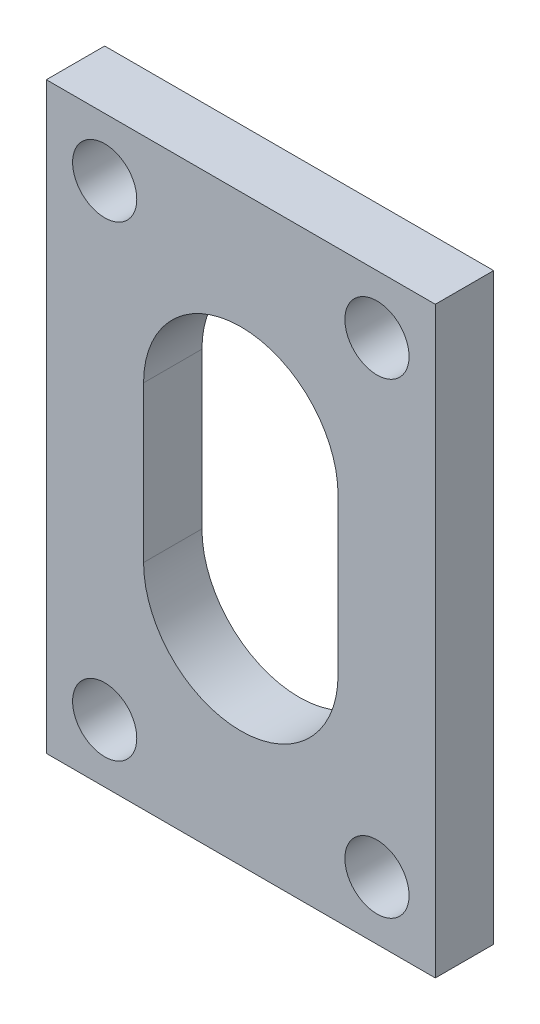
ISO-10303-21;
HEADER;
FILE_DESCRIPTION(('STEP AP214'),'2;1');
FILE_NAME('part.step','',(''),(''),'','','');
FILE_SCHEMA(('AUTOMOTIVE_DESIGN { 1 0 10303 214 1 1 1 1 }'));
ENDSEC;
DATA;
#1=APPLICATION_CONTEXT('core data for automotive mechanical design processes');
#2=APPLICATION_PROTOCOL_DEFINITION('international standard','automotive_design',2000,#1);
#3=PRODUCT_CONTEXT('',#1,'mechanical');
#4=PRODUCT('Part','Part','',(#3));
#5=PRODUCT_RELATED_PRODUCT_CATEGORY('part','',(#4));
#6=PRODUCT_DEFINITION_FORMATION('','',#4);
#7=PRODUCT_DEFINITION_CONTEXT('part definition',#1,'design');
#8=PRODUCT_DEFINITION('design','',#6,#7);
#9=PRODUCT_DEFINITION_SHAPE('','',#8);
#10=(LENGTH_UNIT() NAMED_UNIT(*) SI_UNIT(.MILLI.,.METRE.));
#11=(NAMED_UNIT(*) PLANE_ANGLE_UNIT() SI_UNIT($,.RADIAN.));
#12=(NAMED_UNIT(*) SI_UNIT($,.STERADIAN.) SOLID_ANGLE_UNIT());
#13=UNCERTAINTY_MEASURE_WITH_UNIT(LENGTH_MEASURE(1.E-05),#10,'distance_accuracy_value','');
#14=(GEOMETRIC_REPRESENTATION_CONTEXT(3) GLOBAL_UNCERTAINTY_ASSIGNED_CONTEXT((#13)) GLOBAL_UNIT_ASSIGNED_CONTEXT((#10,
#11,#12)) REPRESENTATION_CONTEXT('',''));
#15=CARTESIAN_POINT('',(0.,0.,0.));
#16=DIRECTION('',(0.,0.,1.));
#17=DIRECTION('',(1.,0.,0.));
#18=AXIS2_PLACEMENT_3D('',#15,#16,#17);
#19=CARTESIAN_POINT('',(0.,0.,3.));
#20=DIRECTION('',(0.,0.,1.));
#21=DIRECTION('',(1.,0.,0.));
#22=AXIS2_PLACEMENT_3D('',#19,#20,#21);
#23=PLANE('',#22);
#24=CARTESIAN_POINT('',(0.,-4.,3.));
#25=DIRECTION('',(0.,0.,1.));
#26=DIRECTION('',(1.,0.,0.));
#27=AXIS2_PLACEMENT_3D('',#24,#25,#26);
#28=CIRCLE('',#27,5.);
#29=CARTESIAN_POINT('',(-5.,-4.,3.));
#30=VERTEX_POINT('',#29);
#31=CARTESIAN_POINT('',(5.,-4.,3.));
#32=VERTEX_POINT('',#31);
#33=EDGE_CURVE('E48',#30,#32,#28,.T.);
#34=ORIENTED_EDGE('',*,*,#33,.F.);
#35=DIRECTION('',(0.,-1.,0.));
#36=VECTOR('',#35,1.);
#37=CARTESIAN_POINT('',(-5.,-4.,3.));
#38=LINE('',#37,#36);
#39=CARTESIAN_POINT('',(-5.,4.,3.));
#40=VERTEX_POINT('',#39);
#41=EDGE_CURVE('E106',#40,#30,#38,.T.);
#42=ORIENTED_EDGE('',*,*,#41,.F.);
#43=CARTESIAN_POINT('',(0.,4.,3.));
#44=DIRECTION('',(0.,0.,1.));
#45=DIRECTION('',(1.,0.,0.));
#46=AXIS2_PLACEMENT_3D('',#43,#44,#45);
#47=CIRCLE('',#46,5.);
#48=CARTESIAN_POINT('',(5.,4.,3.));
#49=VERTEX_POINT('',#48);
#50=EDGE_CURVE('E126',#49,#40,#47,.T.);
#51=ORIENTED_EDGE('',*,*,#50,.F.);
#52=DIRECTION('',(0.,1.,0.));
#53=VECTOR('',#52,1.);
#54=CARTESIAN_POINT('',(5.,-4.,3.));
#55=LINE('',#54,#53);
#56=EDGE_CURVE('E120',#32,#49,#55,.T.);
#57=ORIENTED_EDGE('',*,*,#56,.F.);
#58=EDGE_LOOP('',(#34,#42,#51,#57));
#59=FACE_BOUND('',#58,.T.);
#60=CARTESIAN_POINT('',(7.,-12.,3.));
#61=DIRECTION('',(0.,0.,1.));
#62=DIRECTION('',(1.,0.,0.));
#63=AXIS2_PLACEMENT_3D('',#60,#61,#62);
#64=CIRCLE('',#63,1.65);
#65=CARTESIAN_POINT('',(8.65,-12.,3.));
#66=VERTEX_POINT('',#65);
#67=EDGE_CURVE('E141',#66,#66,#64,.T.);
#68=ORIENTED_EDGE('',*,*,#67,.F.);
#69=EDGE_LOOP('',(#68));
#70=FACE_BOUND('',#69,.T.);
#71=CARTESIAN_POINT('',(-7.,12.,3.));
#72=DIRECTION('',(0.,0.,1.));
#73=DIRECTION('',(1.,0.,0.));
#74=AXIS2_PLACEMENT_3D('',#71,#72,#73);
#75=CIRCLE('',#74,1.65);
#76=CARTESIAN_POINT('',(-5.35,12.,3.));
#77=VERTEX_POINT('',#76);
#78=EDGE_CURVE('E153',#77,#77,#75,.T.);
#79=ORIENTED_EDGE('',*,*,#78,.F.);
#80=EDGE_LOOP('',(#79));
#81=FACE_BOUND('',#80,.T.);
#82=DIRECTION('',(0.,-1.,0.));
#83=VECTOR('',#82,1.);
#84=CARTESIAN_POINT('',(-10.,-15.,3.));
#85=LINE('',#84,#83);
#86=CARTESIAN_POINT('',(-10.,15.,3.));
#87=VERTEX_POINT('',#86);
#88=CARTESIAN_POINT('',(-10.,-15.,3.));
#89=VERTEX_POINT('',#88);
#90=EDGE_CURVE('E159',#87,#89,#85,.T.);
#91=ORIENTED_EDGE('',*,*,#90,.T.);
#92=DIRECTION('',(1.,0.,0.));
#93=VECTOR('',#92,1.);
#94=CARTESIAN_POINT('',(10.,-15.,3.));
#95=LINE('',#94,#93);
#96=CARTESIAN_POINT('',(10.,-15.,3.));
#97=VERTEX_POINT('',#96);
#98=EDGE_CURVE('E162',#89,#97,#95,.T.);
#99=ORIENTED_EDGE('',*,*,#98,.T.);
#100=DIRECTION('',(0.,1.,0.));
#101=VECTOR('',#100,1.);
#102=CARTESIAN_POINT('',(10.,-15.,3.));
#103=LINE('',#102,#101);
#104=CARTESIAN_POINT('',(10.,15.,3.));
#105=VERTEX_POINT('',#104);
#106=EDGE_CURVE('E165',#97,#105,#103,.T.);
#107=ORIENTED_EDGE('',*,*,#106,.T.);
#108=DIRECTION('',(-1.,0.,0.));
#109=VECTOR('',#108,1.);
#110=CARTESIAN_POINT('',(10.,15.,3.));
#111=LINE('',#110,#109);
#112=EDGE_CURVE('E167',#105,#87,#111,.T.);
#113=ORIENTED_EDGE('',*,*,#112,.T.);
#114=EDGE_LOOP('',(#91,#99,#107,#113));
#115=FACE_BOUND('',#114,.T.);
#116=CARTESIAN_POINT('',(7.,12.,3.));
#117=DIRECTION('',(0.,0.,1.));
#118=DIRECTION('',(1.,0.,0.));
#119=AXIS2_PLACEMENT_3D('',#116,#117,#118);
#120=CIRCLE('',#119,1.65);
#121=CARTESIAN_POINT('',(8.65,12.,3.));
#122=VERTEX_POINT('',#121);
#123=EDGE_CURVE('E147',#122,#122,#120,.T.);
#124=ORIENTED_EDGE('',*,*,#123,.F.);
#125=EDGE_LOOP('',(#124));
#126=FACE_BOUND('',#125,.T.);
#127=CARTESIAN_POINT('',(-7.,-12.,3.));
#128=DIRECTION('',(0.,0.,1.));
#129=DIRECTION('',(1.,0.,0.));
#130=AXIS2_PLACEMENT_3D('',#127,#128,#129);
#131=CIRCLE('',#130,1.65);
#132=CARTESIAN_POINT('',(-5.35,-12.,3.));
#133=VERTEX_POINT('',#132);
#134=EDGE_CURVE('E135',#133,#133,#131,.T.);
#135=ORIENTED_EDGE('',*,*,#134,.F.);
#136=EDGE_LOOP('',(#135));
#137=FACE_BOUND('',#136,.T.);
#138=ADVANCED_FACE('F33',(#59,#70,#81,#115,#126,#137),#23,.T.);
#139=CARTESIAN_POINT('',(0.,0.,0.));
#140=DIRECTION('',(0.,0.,1.));
#141=DIRECTION('',(1.,0.,0.));
#142=AXIS2_PLACEMENT_3D('',#139,#140,#141);
#143=PLANE('',#142);
#144=DIRECTION('',(0.,1.,0.));
#145=VECTOR('',#144,1.);
#146=CARTESIAN_POINT('',(-5.,-4.,0.));
#147=LINE('',#146,#145);
#148=CARTESIAN_POINT('',(-5.,-4.,0.));
#149=VERTEX_POINT('',#148);
#150=CARTESIAN_POINT('',(-5.,4.,0.));
#151=VERTEX_POINT('',#150);
#152=EDGE_CURVE('E118',#149,#151,#147,.T.);
#153=ORIENTED_EDGE('',*,*,#152,.F.);
#154=CARTESIAN_POINT('',(0.,-4.,0.));
#155=DIRECTION('',(0.,0.,1.));
#156=DIRECTION('',(1.,0.,0.));
#157=AXIS2_PLACEMENT_3D('',#154,#155,#156);
#158=CIRCLE('',#157,5.);
#159=CARTESIAN_POINT('',(5.,-4.,0.));
#160=VERTEX_POINT('',#159);
#161=EDGE_CURVE('E100',#160,#149,#158,.F.);
#162=ORIENTED_EDGE('',*,*,#161,.F.);
#163=DIRECTION('',(0.,-1.,0.));
#164=VECTOR('',#163,1.);
#165=CARTESIAN_POINT('',(5.,-4.,0.));
#166=LINE('',#165,#164);
#167=CARTESIAN_POINT('',(5.,4.,0.));
#168=VERTEX_POINT('',#167);
#169=EDGE_CURVE('E109',#168,#160,#166,.T.);
#170=ORIENTED_EDGE('',*,*,#169,.F.);
#171=CARTESIAN_POINT('',(0.,4.,0.));
#172=DIRECTION('',(0.,0.,1.));
#173=DIRECTION('',(1.,0.,0.));
#174=AXIS2_PLACEMENT_3D('',#171,#172,#173);
#175=CIRCLE('',#174,5.);
#176=EDGE_CURVE('E56',#151,#168,#175,.F.);
#177=ORIENTED_EDGE('',*,*,#176,.F.);
#178=EDGE_LOOP('',(#153,#162,#170,#177));
#179=FACE_BOUND('',#178,.T.);
#180=CARTESIAN_POINT('',(7.,-12.,0.));
#181=DIRECTION('',(0.,0.,1.));
#182=DIRECTION('',(1.,0.,0.));
#183=AXIS2_PLACEMENT_3D('',#180,#181,#182);
#184=CIRCLE('',#183,1.65);
#185=CARTESIAN_POINT('',(8.65,-12.,0.));
#186=VERTEX_POINT('',#185);
#187=EDGE_CURVE('E138',#186,#186,#184,.T.);
#188=ORIENTED_EDGE('',*,*,#187,.T.);
#189=EDGE_LOOP('',(#188));
#190=FACE_BOUND('',#189,.T.);
#191=CARTESIAN_POINT('',(-7.,12.,0.));
#192=DIRECTION('',(0.,0.,1.));
#193=DIRECTION('',(1.,0.,0.));
#194=AXIS2_PLACEMENT_3D('',#191,#192,#193);
#195=CIRCLE('',#194,1.65);
#196=CARTESIAN_POINT('',(-5.35,12.,0.));
#197=VERTEX_POINT('',#196);
#198=EDGE_CURVE('E150',#197,#197,#195,.T.);
#199=ORIENTED_EDGE('',*,*,#198,.T.);
#200=EDGE_LOOP('',(#199));
#201=FACE_BOUND('',#200,.T.);
#202=DIRECTION('',(0.,-1.,0.));
#203=VECTOR('',#202,1.);
#204=CARTESIAN_POINT('',(-10.,-15.,0.));
#205=LINE('',#204,#203);
#206=CARTESIAN_POINT('',(-10.,15.,0.));
#207=VERTEX_POINT('',#206);
#208=CARTESIAN_POINT('',(-10.,-15.,0.));
#209=VERTEX_POINT('',#208);
#210=EDGE_CURVE('E156',#207,#209,#205,.T.);
#211=ORIENTED_EDGE('',*,*,#210,.F.);
#212=DIRECTION('',(-1.,0.,0.));
#213=VECTOR('',#212,1.);
#214=CARTESIAN_POINT('',(10.,15.,0.));
#215=LINE('',#214,#213);
#216=CARTESIAN_POINT('',(10.,15.,0.));
#217=VERTEX_POINT('',#216);
#218=EDGE_CURVE('E163',#217,#207,#215,.T.);
#219=ORIENTED_EDGE('',*,*,#218,.F.);
#220=DIRECTION('',(0.,1.,0.));
#221=VECTOR('',#220,1.);
#222=CARTESIAN_POINT('',(10.,-15.,0.));
#223=LINE('',#222,#221);
#224=CARTESIAN_POINT('',(10.,-15.,0.));
#225=VERTEX_POINT('',#224);
#226=EDGE_CURVE('E174',#225,#217,#223,.T.);
#227=ORIENTED_EDGE('',*,*,#226,.F.);
#228=DIRECTION('',(1.,0.,0.));
#229=VECTOR('',#228,1.);
#230=CARTESIAN_POINT('',(10.,-15.,0.));
#231=LINE('',#230,#229);
#232=EDGE_CURVE('E172',#209,#225,#231,.T.);
#233=ORIENTED_EDGE('',*,*,#232,.F.);
#234=EDGE_LOOP('',(#211,#219,#227,#233));
#235=FACE_BOUND('',#234,.T.);
#236=CARTESIAN_POINT('',(7.,12.,0.));
#237=DIRECTION('',(0.,0.,1.));
#238=DIRECTION('',(1.,0.,0.));
#239=AXIS2_PLACEMENT_3D('',#236,#237,#238);
#240=CIRCLE('',#239,1.65);
#241=CARTESIAN_POINT('',(8.65,12.,0.));
#242=VERTEX_POINT('',#241);
#243=EDGE_CURVE('E144',#242,#242,#240,.T.);
#244=ORIENTED_EDGE('',*,*,#243,.T.);
#245=EDGE_LOOP('',(#244));
#246=FACE_BOUND('',#245,.T.);
#247=CARTESIAN_POINT('',(-7.,-12.,0.));
#248=DIRECTION('',(0.,0.,1.));
#249=DIRECTION('',(1.,0.,0.));
#250=AXIS2_PLACEMENT_3D('',#247,#248,#249);
#251=CIRCLE('',#250,1.65);
#252=CARTESIAN_POINT('',(-5.35,-12.,0.));
#253=VERTEX_POINT('',#252);
#254=EDGE_CURVE('E112',#253,#253,#251,.T.);
#255=ORIENTED_EDGE('',*,*,#254,.T.);
#256=EDGE_LOOP('',(#255));
#257=FACE_BOUND('',#256,.T.);
#258=ADVANCED_FACE('F115',(#179,#190,#201,#235,#246,#257),#143,.F.);
#259=CARTESIAN_POINT('',(-10.,-15.,3.));
#260=DIRECTION('',(1.,0.,0.));
#261=DIRECTION('',(0.,0.,-1.));
#262=AXIS2_PLACEMENT_3D('',#259,#260,#261);
#263=PLANE('',#262);
#264=ORIENTED_EDGE('',*,*,#210,.T.);
#265=DIRECTION('',(0.,0.,-1.));
#266=VECTOR('',#265,1.);
#267=CARTESIAN_POINT('',(-10.,-15.,3.));
#268=LINE('',#267,#266);
#269=EDGE_CURVE('E11',#89,#209,#268,.T.);
#270=ORIENTED_EDGE('',*,*,#269,.F.);
#271=ORIENTED_EDGE('',*,*,#90,.F.);
#272=DIRECTION('',(0.,0.,-1.));
#273=VECTOR('',#272,1.);
#274=CARTESIAN_POINT('',(-10.,15.,3.));
#275=LINE('',#274,#273);
#276=EDGE_CURVE('E169',#87,#207,#275,.T.);
#277=ORIENTED_EDGE('',*,*,#276,.T.);
#278=EDGE_LOOP('',(#264,#270,#271,#277));
#279=FACE_BOUND('',#278,.T.);
#280=ADVANCED_FACE('F35',(#279),#263,.F.);
#281=CARTESIAN_POINT('',(10.,-15.,3.));
#282=DIRECTION('',(0.,1.,0.));
#283=DIRECTION('',(-1.,0.,0.));
#284=AXIS2_PLACEMENT_3D('',#281,#282,#283);
#285=PLANE('',#284);
#286=ORIENTED_EDGE('',*,*,#232,.T.);
#287=DIRECTION('',(0.,0.,-1.));
#288=VECTOR('',#287,1.);
#289=CARTESIAN_POINT('',(10.,-15.,3.));
#290=LINE('',#289,#288);
#291=EDGE_CURVE('E41',#97,#225,#290,.T.);
#292=ORIENTED_EDGE('',*,*,#291,.F.);
#293=ORIENTED_EDGE('',*,*,#98,.F.);
#294=ORIENTED_EDGE('',*,*,#269,.T.);
#295=EDGE_LOOP('',(#286,#292,#293,#294));
#296=FACE_BOUND('',#295,.T.);
#297=ADVANCED_FACE('F202',(#296),#285,.F.);
#298=CARTESIAN_POINT('',(10.,-15.,3.));
#299=DIRECTION('',(-1.,0.,0.));
#300=DIRECTION('',(0.,0.,1.));
#301=AXIS2_PLACEMENT_3D('',#298,#299,#300);
#302=PLANE('',#301);
#303=ORIENTED_EDGE('',*,*,#226,.T.);
#304=DIRECTION('',(0.,0.,-1.));
#305=VECTOR('',#304,1.);
#306=CARTESIAN_POINT('',(10.,15.,3.));
#307=LINE('',#306,#305);
#308=EDGE_CURVE('E179',#105,#217,#307,.T.);
#309=ORIENTED_EDGE('',*,*,#308,.F.);
#310=ORIENTED_EDGE('',*,*,#106,.F.);
#311=ORIENTED_EDGE('',*,*,#291,.T.);
#312=EDGE_LOOP('',(#303,#309,#310,#311));
#313=FACE_BOUND('',#312,.T.);
#314=ADVANCED_FACE('F186',(#313),#302,.F.);
#315=CARTESIAN_POINT('',(10.,15.,3.));
#316=DIRECTION('',(0.,-1.,0.));
#317=DIRECTION('',(1.,0.,0.));
#318=AXIS2_PLACEMENT_3D('',#315,#316,#317);
#319=PLANE('',#318);
#320=ORIENTED_EDGE('',*,*,#218,.T.);
#321=ORIENTED_EDGE('',*,*,#276,.F.);
#322=ORIENTED_EDGE('',*,*,#112,.F.);
#323=ORIENTED_EDGE('',*,*,#308,.T.);
#324=EDGE_LOOP('',(#320,#321,#322,#323));
#325=FACE_BOUND('',#324,.T.);
#326=ADVANCED_FACE('F195',(#325),#319,.F.);
#327=CARTESIAN_POINT('',(-7.,12.,3.));
#328=DIRECTION('',(0.,0.,-1.));
#329=DIRECTION('',(-1.,0.,0.));
#330=AXIS2_PLACEMENT_3D('',#327,#328,#329);
#331=CYLINDRICAL_SURFACE('',#330,1.65);
#332=ORIENTED_EDGE('',*,*,#78,.T.);
#333=EDGE_LOOP('',(#332));
#334=FACE_BOUND('',#333,.T.);
#335=ORIENTED_EDGE('',*,*,#198,.F.);
#336=EDGE_LOOP('',(#335));
#337=FACE_BOUND('',#336,.T.);
#338=ADVANCED_FACE('F218',(#334,#337),#331,.F.);
#339=CARTESIAN_POINT('',(7.,12.,3.));
#340=DIRECTION('',(0.,0.,-1.));
#341=DIRECTION('',(-1.,0.,0.));
#342=AXIS2_PLACEMENT_3D('',#339,#340,#341);
#343=CYLINDRICAL_SURFACE('',#342,1.65);
#344=ORIENTED_EDGE('',*,*,#123,.T.);
#345=EDGE_LOOP('',(#344));
#346=FACE_BOUND('',#345,.T.);
#347=ORIENTED_EDGE('',*,*,#243,.F.);
#348=EDGE_LOOP('',(#347));
#349=FACE_BOUND('',#348,.T.);
#350=ADVANCED_FACE('F225',(#346,#349),#343,.F.);
#351=CARTESIAN_POINT('',(7.,-12.,3.));
#352=DIRECTION('',(0.,0.,-1.));
#353=DIRECTION('',(-1.,0.,0.));
#354=AXIS2_PLACEMENT_3D('',#351,#352,#353);
#355=CYLINDRICAL_SURFACE('',#354,1.65);
#356=ORIENTED_EDGE('',*,*,#67,.T.);
#357=EDGE_LOOP('',(#356));
#358=FACE_BOUND('',#357,.T.);
#359=ORIENTED_EDGE('',*,*,#187,.F.);
#360=EDGE_LOOP('',(#359));
#361=FACE_BOUND('',#360,.T.);
#362=ADVANCED_FACE('F230',(#358,#361),#355,.F.);
#363=CARTESIAN_POINT('',(-7.,-12.,3.));
#364=DIRECTION('',(0.,0.,-1.));
#365=DIRECTION('',(-1.,0.,0.));
#366=AXIS2_PLACEMENT_3D('',#363,#364,#365);
#367=CYLINDRICAL_SURFACE('',#366,1.65);
#368=ORIENTED_EDGE('',*,*,#134,.T.);
#369=EDGE_LOOP('',(#368));
#370=FACE_BOUND('',#369,.T.);
#371=ORIENTED_EDGE('',*,*,#254,.F.);
#372=EDGE_LOOP('',(#371));
#373=FACE_BOUND('',#372,.T.);
#374=ADVANCED_FACE('F240',(#370,#373),#367,.F.);
#375=CARTESIAN_POINT('',(0.,-4.,-0.00100000000000013));
#376=DIRECTION('',(0.,0.,1.));
#377=DIRECTION('',(1.,0.,0.));
#378=AXIS2_PLACEMENT_3D('',#375,#376,#377);
#379=CYLINDRICAL_SURFACE('',#378,5.);
#380=ORIENTED_EDGE('',*,*,#161,.T.);
#381=DIRECTION('',(0.,0.,1.));
#382=VECTOR('',#381,1.);
#383=CARTESIAN_POINT('',(-5.,-4.,-0.00100000000000013));
#384=LINE('',#383,#382);
#385=EDGE_CURVE('E113',#149,#30,#384,.T.);
#386=ORIENTED_EDGE('',*,*,#385,.T.);
#387=ORIENTED_EDGE('',*,*,#33,.T.);
#388=DIRECTION('',(0.,0.,1.));
#389=VECTOR('',#388,1.);
#390=CARTESIAN_POINT('',(5.,-4.,-0.00100000000000013));
#391=LINE('',#390,#389);
#392=EDGE_CURVE('E96',#160,#32,#391,.T.);
#393=ORIENTED_EDGE('',*,*,#392,.F.);
#394=EDGE_LOOP('',(#380,#386,#387,#393));
#395=FACE_BOUND('',#394,.T.);
#396=ADVANCED_FACE('F98',(#395),#379,.F.);
#397=CARTESIAN_POINT('',(-5.,-4.,-0.00100000000000013));
#398=DIRECTION('',(-1.,0.,0.));
#399=DIRECTION('',(0.,-1.,0.));
#400=AXIS2_PLACEMENT_3D('',#397,#398,#399);
#401=PLANE('',#400);
#402=ORIENTED_EDGE('',*,*,#152,.T.);
#403=DIRECTION('',(0.,0.,1.));
#404=VECTOR('',#403,1.);
#405=CARTESIAN_POINT('',(-5.,4.,-0.00100000000000013));
#406=LINE('',#405,#404);
#407=EDGE_CURVE('E132',#151,#40,#406,.T.);
#408=ORIENTED_EDGE('',*,*,#407,.T.);
#409=ORIENTED_EDGE('',*,*,#41,.T.);
#410=ORIENTED_EDGE('',*,*,#385,.F.);
#411=EDGE_LOOP('',(#402,#408,#409,#410));
#412=FACE_BOUND('',#411,.T.);
#413=ADVANCED_FACE('F250',(#412),#401,.F.);
#414=CARTESIAN_POINT('',(0.,4.,-0.00100000000000013));
#415=DIRECTION('',(0.,0.,1.));
#416=DIRECTION('',(1.,0.,0.));
#417=AXIS2_PLACEMENT_3D('',#414,#415,#416);
#418=CYLINDRICAL_SURFACE('',#417,5.);
#419=ORIENTED_EDGE('',*,*,#176,.T.);
#420=DIRECTION('',(0.,0.,1.));
#421=VECTOR('',#420,1.);
#422=CARTESIAN_POINT('',(5.,4.,-0.00100000000000013));
#423=LINE('',#422,#421);
#424=EDGE_CURVE('E105',#168,#49,#423,.T.);
#425=ORIENTED_EDGE('',*,*,#424,.T.);
#426=ORIENTED_EDGE('',*,*,#50,.T.);
#427=ORIENTED_EDGE('',*,*,#407,.F.);
#428=EDGE_LOOP('',(#419,#425,#426,#427));
#429=FACE_BOUND('',#428,.T.);
#430=ADVANCED_FACE('F253',(#429),#418,.F.);
#431=CARTESIAN_POINT('',(5.,-4.,-0.00100000000000013));
#432=DIRECTION('',(1.,0.,0.));
#433=DIRECTION('',(0.,1.,0.));
#434=AXIS2_PLACEMENT_3D('',#431,#432,#433);
#435=PLANE('',#434);
#436=ORIENTED_EDGE('',*,*,#169,.T.);
#437=ORIENTED_EDGE('',*,*,#392,.T.);
#438=ORIENTED_EDGE('',*,*,#56,.T.);
#439=ORIENTED_EDGE('',*,*,#424,.F.);
#440=EDGE_LOOP('',(#436,#437,#438,#439));
#441=FACE_BOUND('',#440,.T.);
#442=ADVANCED_FACE('F110',(#441),#435,.F.);
#443=CLOSED_SHELL('',(#138,#258,#280,#297,#314,#326,#338,#350,#362,#374,#396,#413,#430,#442));
#444=MANIFOLD_SOLID_BREP('B2',#443);
#445=ADVANCED_BREP_SHAPE_REPRESENTATION('',(#18,#444),#14);
#446=SHAPE_DEFINITION_REPRESENTATION(#9,#445);
ENDSEC;
END-ISO-10303-21;
